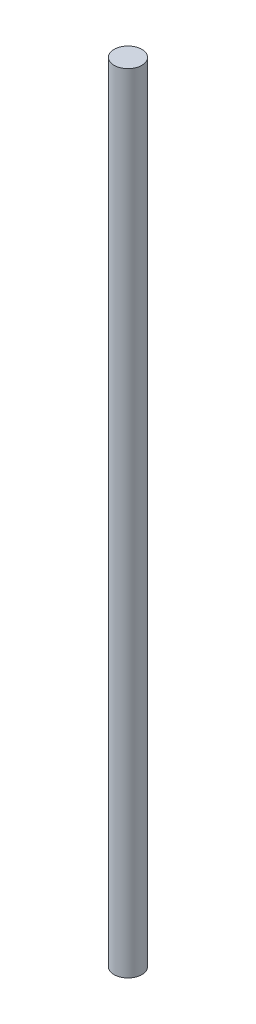
ISO-10303-21;
HEADER;
FILE_DESCRIPTION(('STEP AP214'),'2;1');
FILE_NAME('part.step','',(''),(''),'','','');
FILE_SCHEMA(('AUTOMOTIVE_DESIGN { 1 0 10303 214 1 1 1 1 }'));
ENDSEC;
DATA;
#1=APPLICATION_CONTEXT('core data for automotive mechanical design processes');
#2=APPLICATION_PROTOCOL_DEFINITION('international standard','automotive_design',2000,#1);
#3=PRODUCT_CONTEXT('',#1,'mechanical');
#4=PRODUCT('Part','Part','',(#3));
#5=PRODUCT_RELATED_PRODUCT_CATEGORY('part','',(#4));
#6=PRODUCT_DEFINITION_FORMATION('','',#4);
#7=PRODUCT_DEFINITION_CONTEXT('part definition',#1,'design');
#8=PRODUCT_DEFINITION('design','',#6,#7);
#9=PRODUCT_DEFINITION_SHAPE('','',#8);
#10=(LENGTH_UNIT() NAMED_UNIT(*) SI_UNIT(.MILLI.,.METRE.));
#11=(NAMED_UNIT(*) PLANE_ANGLE_UNIT() SI_UNIT($,.RADIAN.));
#12=(NAMED_UNIT(*) SI_UNIT($,.STERADIAN.) SOLID_ANGLE_UNIT());
#13=UNCERTAINTY_MEASURE_WITH_UNIT(LENGTH_MEASURE(1.E-05),#10,'distance_accuracy_value','');
#14=(GEOMETRIC_REPRESENTATION_CONTEXT(3) GLOBAL_UNCERTAINTY_ASSIGNED_CONTEXT((#13)) GLOBAL_UNIT_ASSIGNED_CONTEXT((#10,
#11,#12)) REPRESENTATION_CONTEXT('',''));
#15=CARTESIAN_POINT('',(0.,0.,0.));
#16=DIRECTION('',(0.,0.,1.));
#17=DIRECTION('',(1.,0.,0.));
#18=AXIS2_PLACEMENT_3D('',#15,#16,#17);
#19=CARTESIAN_POINT('',(0.,142.,0.));
#20=DIRECTION('',(0.,-1.,0.));
#21=DIRECTION('',(0.,0.,-1.));
#22=AXIS2_PLACEMENT_3D('',#19,#20,#21);
#23=CYLINDRICAL_SURFACE('',#22,2.5);
#24=CARTESIAN_POINT('',(0.,142.,0.));
#25=DIRECTION('',(0.,1.,0.));
#26=DIRECTION('',(0.,0.,1.));
#27=AXIS2_PLACEMENT_3D('',#24,#25,#26);
#28=CIRCLE('',#27,2.5);
#29=CARTESIAN_POINT('',(0.,142.,2.5));
#30=VERTEX_POINT('',#29);
#31=EDGE_CURVE('E10',#30,#30,#28,.T.);
#32=ORIENTED_EDGE('',*,*,#31,.F.);
#33=EDGE_LOOP('',(#32));
#34=FACE_BOUND('',#33,.T.);
#35=CARTESIAN_POINT('',(0.,0.,0.));
#36=DIRECTION('',(0.,1.,0.));
#37=DIRECTION('',(0.,0.,1.));
#38=AXIS2_PLACEMENT_3D('',#35,#36,#37);
#39=CIRCLE('',#38,2.5);
#40=CARTESIAN_POINT('',(0.,0.,2.5));
#41=VERTEX_POINT('',#40);
#42=EDGE_CURVE('E40',#41,#41,#39,.T.);
#43=ORIENTED_EDGE('',*,*,#42,.T.);
#44=EDGE_LOOP('',(#43));
#45=FACE_BOUND('',#44,.T.);
#46=ADVANCED_FACE('F37',(#34,#45),#23,.T.);
#47=CARTESIAN_POINT('',(0.,142.,0.));
#48=DIRECTION('',(0.,1.,0.));
#49=DIRECTION('',(0.,0.,1.));
#50=AXIS2_PLACEMENT_3D('',#47,#48,#49);
#51=PLANE('',#50);
#52=ORIENTED_EDGE('',*,*,#31,.T.);
#53=EDGE_LOOP('',(#52));
#54=FACE_BOUND('',#53,.T.);
#55=ADVANCED_FACE('F54',(#54),#51,.T.);
#56=CARTESIAN_POINT('',(0.,0.,0.));
#57=DIRECTION('',(0.,1.,0.));
#58=DIRECTION('',(0.,0.,1.));
#59=AXIS2_PLACEMENT_3D('',#56,#57,#58);
#60=PLANE('',#59);
#61=ORIENTED_EDGE('',*,*,#42,.F.);
#62=EDGE_LOOP('',(#61));
#63=FACE_BOUND('',#62,.T.);
#64=ADVANCED_FACE('F52',(#63),#60,.F.);
#65=CLOSED_SHELL('',(#46,#55,#64));
#66=MANIFOLD_SOLID_BREP('B2',#65);
#67=ADVANCED_BREP_SHAPE_REPRESENTATION('',(#18,#66),#14);
#68=SHAPE_DEFINITION_REPRESENTATION(#9,#67);
ENDSEC;
END-ISO-10303-21;
